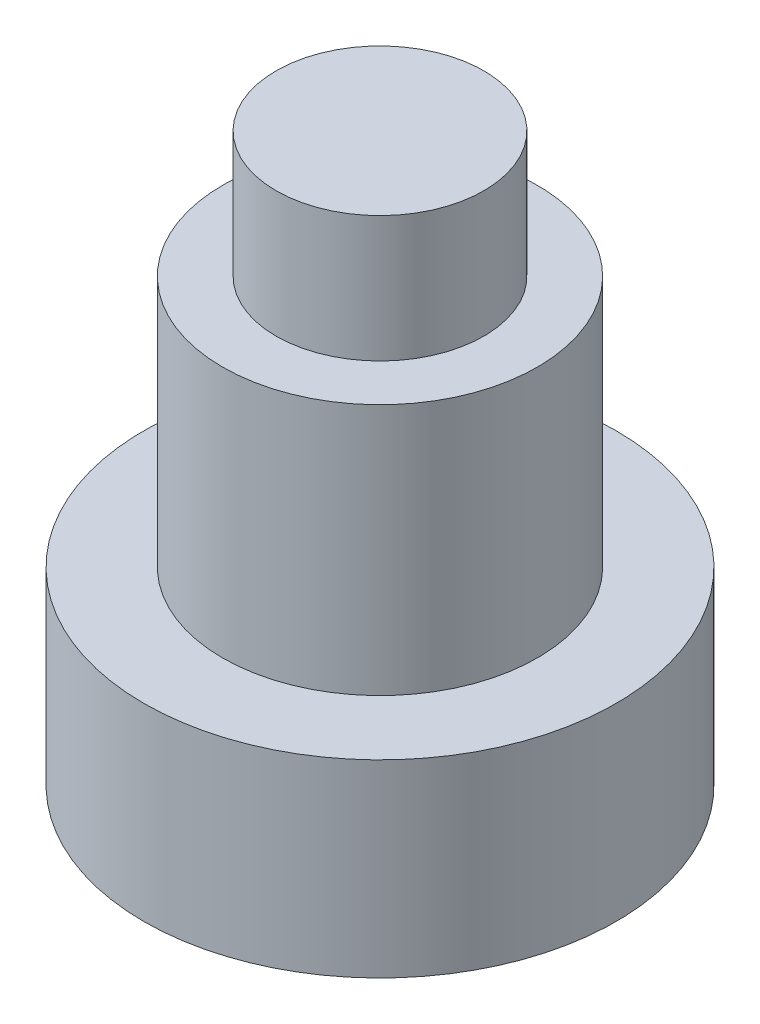
ISO-10303-21;
HEADER;
FILE_DESCRIPTION(('STEP AP214'),'2;1');
FILE_NAME('part.step','',(''),(''),'','','');
FILE_SCHEMA(('AUTOMOTIVE_DESIGN { 1 0 10303 214 1 1 1 1 }'));
ENDSEC;
DATA;
#1=APPLICATION_CONTEXT('core data for automotive mechanical design processes');
#2=APPLICATION_PROTOCOL_DEFINITION('international standard','automotive_design',2000,#1);
#3=PRODUCT_CONTEXT('',#1,'mechanical');
#4=PRODUCT('Part','Part','',(#3));
#5=PRODUCT_RELATED_PRODUCT_CATEGORY('part','',(#4));
#6=PRODUCT_DEFINITION_FORMATION('','',#4);
#7=PRODUCT_DEFINITION_CONTEXT('part definition',#1,'design');
#8=PRODUCT_DEFINITION('design','',#6,#7);
#9=PRODUCT_DEFINITION_SHAPE('','',#8);
#10=(LENGTH_UNIT() NAMED_UNIT(*) SI_UNIT(.MILLI.,.METRE.));
#11=(NAMED_UNIT(*) PLANE_ANGLE_UNIT() SI_UNIT($,.RADIAN.));
#12=(NAMED_UNIT(*) SI_UNIT($,.STERADIAN.) SOLID_ANGLE_UNIT());
#13=UNCERTAINTY_MEASURE_WITH_UNIT(LENGTH_MEASURE(1.E-05),#10,'distance_accuracy_value','');
#14=(GEOMETRIC_REPRESENTATION_CONTEXT(3) GLOBAL_UNCERTAINTY_ASSIGNED_CONTEXT((#13)) GLOBAL_UNIT_ASSIGNED_CONTEXT((#10,
#11,#12)) REPRESENTATION_CONTEXT('',''));
#15=CARTESIAN_POINT('',(0.,0.,0.));
#16=DIRECTION('',(0.,0.,1.));
#17=DIRECTION('',(1.,0.,0.));
#18=AXIS2_PLACEMENT_3D('',#15,#16,#17);
#19=CARTESIAN_POINT('',(0.,7.,0.));
#20=DIRECTION('',(0.,-1.,0.));
#21=DIRECTION('',(0.,0.,-1.));
#22=AXIS2_PLACEMENT_3D('',#19,#20,#21);
#23=CYLINDRICAL_SURFACE('',#22,3.75);
#24=CARTESIAN_POINT('',(0.,0.,0.));
#25=DIRECTION('',(0.,1.,0.));
#26=DIRECTION('',(0.,0.,1.));
#27=AXIS2_PLACEMENT_3D('',#24,#25,#26);
#28=CIRCLE('',#27,3.75);
#29=CARTESIAN_POINT('',(0.,0.,3.75));
#30=VERTEX_POINT('',#29);
#31=EDGE_CURVE('E39',#30,#30,#28,.T.);
#32=ORIENTED_EDGE('',*,*,#31,.T.);
#33=EDGE_LOOP('',(#32));
#34=FACE_BOUND('',#33,.T.);
#35=CARTESIAN_POINT('',(0.,3.,0.));
#36=DIRECTION('',(0.,1.,0.));
#37=DIRECTION('',(0.,0.,1.));
#38=AXIS2_PLACEMENT_3D('',#35,#36,#37);
#39=CIRCLE('',#38,3.75);
#40=CARTESIAN_POINT('',(0.,3.,3.75));
#41=VERTEX_POINT('',#40);
#42=EDGE_CURVE('E47',#41,#41,#39,.T.);
#43=ORIENTED_EDGE('',*,*,#42,.F.);
#44=EDGE_LOOP('',(#43));
#45=FACE_BOUND('',#44,.T.);
#46=ADVANCED_FACE('F36',(#34,#45),#23,.T.);
#47=CARTESIAN_POINT('',(0.,0.,0.));
#48=DIRECTION('',(0.,1.,0.));
#49=DIRECTION('',(0.,0.,1.));
#50=AXIS2_PLACEMENT_3D('',#47,#48,#49);
#51=PLANE('',#50);
#52=ORIENTED_EDGE('',*,*,#31,.F.);
#53=EDGE_LOOP('',(#52));
#54=FACE_BOUND('',#53,.T.);
#55=ADVANCED_FACE('F62',(#54),#51,.F.);
#56=CARTESIAN_POINT('',(0.,3.,0.));
#57=DIRECTION('',(0.,1.,0.));
#58=DIRECTION('',(0.,0.,1.));
#59=AXIS2_PLACEMENT_3D('',#56,#57,#58);
#60=PLANE('',#59);
#61=CARTESIAN_POINT('',(0.,3.,0.));
#62=DIRECTION('',(0.,1.,0.));
#63=DIRECTION('',(0.,0.,1.));
#64=AXIS2_PLACEMENT_3D('',#61,#62,#63);
#65=CIRCLE('',#64,2.5);
#66=CARTESIAN_POINT('',(0.,3.,2.5));
#67=VERTEX_POINT('',#66);
#68=EDGE_CURVE('E51',#67,#67,#65,.T.);
#69=ORIENTED_EDGE('',*,*,#68,.F.);
#70=EDGE_LOOP('',(#69));
#71=FACE_BOUND('',#70,.T.);
#72=ORIENTED_EDGE('',*,*,#42,.T.);
#73=EDGE_LOOP('',(#72));
#74=FACE_BOUND('',#73,.T.);
#75=ADVANCED_FACE('F59',(#71,#74),#60,.T.);
#76=CARTESIAN_POINT('',(0.,3.,0.));
#77=DIRECTION('',(0.,1.,0.));
#78=DIRECTION('',(0.,0.,1.));
#79=AXIS2_PLACEMENT_3D('',#76,#77,#78);
#80=CYLINDRICAL_SURFACE('',#79,2.5);
#81=ORIENTED_EDGE('',*,*,#68,.T.);
#82=EDGE_LOOP('',(#81));
#83=FACE_BOUND('',#82,.T.);
#84=CARTESIAN_POINT('',(0.,7.,0.));
#85=DIRECTION('',(0.,1.,0.));
#86=DIRECTION('',(0.,0.,1.));
#87=AXIS2_PLACEMENT_3D('',#84,#85,#86);
#88=CIRCLE('',#87,2.5);
#89=CARTESIAN_POINT('',(0.,7.,2.5));
#90=VERTEX_POINT('',#89);
#91=EDGE_CURVE('E54',#90,#90,#88,.T.);
#92=ORIENTED_EDGE('',*,*,#91,.F.);
#93=EDGE_LOOP('',(#92));
#94=FACE_BOUND('',#93,.T.);
#95=ADVANCED_FACE('F74',(#83,#94),#80,.T.);
#96=CARTESIAN_POINT('',(0.,7.,0.));
#97=DIRECTION('',(0.,1.,0.));
#98=DIRECTION('',(0.,0.,1.));
#99=AXIS2_PLACEMENT_3D('',#96,#97,#98);
#100=PLANE('',#99);
#101=CARTESIAN_POINT('',(0.,7.,0.));
#102=DIRECTION('',(0.,1.,0.));
#103=DIRECTION('',(0.,0.,1.));
#104=AXIS2_PLACEMENT_3D('',#101,#102,#103);
#105=CIRCLE('',#104,1.65);
#106=CARTESIAN_POINT('',(0.,7.,1.65));
#107=VERTEX_POINT('',#106);
#108=EDGE_CURVE('E10',#107,#107,#105,.T.);
#109=ORIENTED_EDGE('',*,*,#108,.F.);
#110=EDGE_LOOP('',(#109));
#111=FACE_BOUND('',#110,.T.);
#112=ORIENTED_EDGE('',*,*,#91,.T.);
#113=EDGE_LOOP('',(#112));
#114=FACE_BOUND('',#113,.T.);
#115=ADVANCED_FACE('F78',(#111,#114),#100,.T.);
#116=CARTESIAN_POINT('',(0.,9.,0.));
#117=DIRECTION('',(0.,-1.,0.));
#118=DIRECTION('',(0.,0.,-1.));
#119=AXIS2_PLACEMENT_3D('',#116,#117,#118);
#120=CYLINDRICAL_SURFACE('',#119,1.65);
#121=CARTESIAN_POINT('',(0.,9.,0.));
#122=DIRECTION('',(0.,1.,0.));
#123=DIRECTION('',(0.,0.,1.));
#124=AXIS2_PLACEMENT_3D('',#121,#122,#123);
#125=CIRCLE('',#124,1.65);
#126=CARTESIAN_POINT('',(0.,9.,1.65));
#127=VERTEX_POINT('',#126);
#128=EDGE_CURVE('E50',#127,#127,#125,.T.);
#129=ORIENTED_EDGE('',*,*,#128,.F.);
#130=EDGE_LOOP('',(#129));
#131=FACE_BOUND('',#130,.T.);
#132=ORIENTED_EDGE('',*,*,#108,.T.);
#133=EDGE_LOOP('',(#132));
#134=FACE_BOUND('',#133,.T.);
#135=ADVANCED_FACE('F80',(#131,#134),#120,.T.);
#136=CARTESIAN_POINT('',(0.,9.,0.));
#137=DIRECTION('',(0.,1.,0.));
#138=DIRECTION('',(0.,0.,1.));
#139=AXIS2_PLACEMENT_3D('',#136,#137,#138);
#140=PLANE('',#139);
#141=ORIENTED_EDGE('',*,*,#128,.T.);
#142=EDGE_LOOP('',(#141));
#143=FACE_BOUND('',#142,.T.);
#144=ADVANCED_FACE('F88',(#143),#140,.T.);
#145=CLOSED_SHELL('',(#46,#55,#75,#95,#115,#135,#144));
#146=MANIFOLD_SOLID_BREP('B2',#145);
#147=ADVANCED_BREP_SHAPE_REPRESENTATION('',(#18,#146),#14);
#148=SHAPE_DEFINITION_REPRESENTATION(#9,#147);
ENDSEC;
END-ISO-10303-21;
